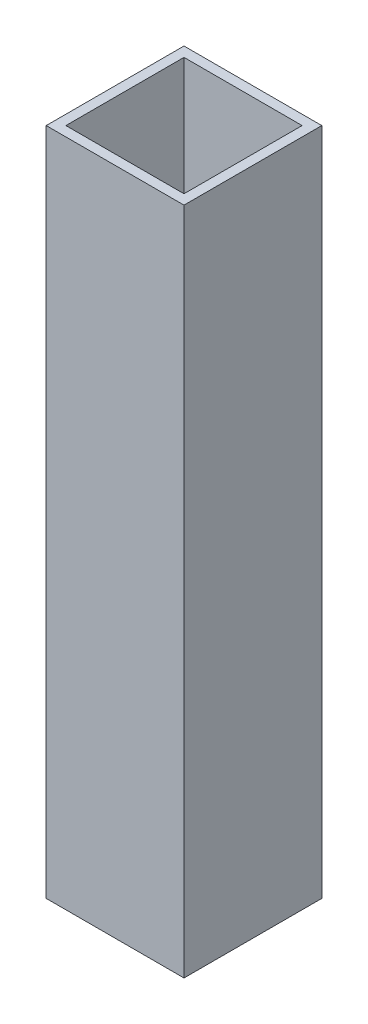
ISO-10303-21;
HEADER;
FILE_DESCRIPTION(('STEP AP214'),'2;1');
FILE_NAME('part.step','',(''),(''),'','','');
FILE_SCHEMA(('AUTOMOTIVE_DESIGN { 1 0 10303 214 1 1 1 1 }'));
ENDSEC;
DATA;
#1=APPLICATION_CONTEXT('core data for automotive mechanical design processes');
#2=APPLICATION_PROTOCOL_DEFINITION('international standard','automotive_design',2000,#1);
#3=PRODUCT_CONTEXT('',#1,'mechanical');
#4=PRODUCT('Part','Part','',(#3));
#5=PRODUCT_RELATED_PRODUCT_CATEGORY('part','',(#4));
#6=PRODUCT_DEFINITION_FORMATION('','',#4);
#7=PRODUCT_DEFINITION_CONTEXT('part definition',#1,'design');
#8=PRODUCT_DEFINITION('design','',#6,#7);
#9=PRODUCT_DEFINITION_SHAPE('','',#8);
#10=(LENGTH_UNIT() NAMED_UNIT(*) SI_UNIT(.MILLI.,.METRE.));
#11=(NAMED_UNIT(*) PLANE_ANGLE_UNIT() SI_UNIT($,.RADIAN.));
#12=(NAMED_UNIT(*) SI_UNIT($,.STERADIAN.) SOLID_ANGLE_UNIT());
#13=UNCERTAINTY_MEASURE_WITH_UNIT(LENGTH_MEASURE(1.E-05),#10,'distance_accuracy_value','');
#14=(GEOMETRIC_REPRESENTATION_CONTEXT(3) GLOBAL_UNCERTAINTY_ASSIGNED_CONTEXT((#13)) GLOBAL_UNIT_ASSIGNED_CONTEXT((#10,
#11,#12)) REPRESENTATION_CONTEXT('',''));
#15=CARTESIAN_POINT('',(0.,0.,0.));
#16=DIRECTION('',(0.,0.,1.));
#17=DIRECTION('',(1.,0.,0.));
#18=AXIS2_PLACEMENT_3D('',#15,#16,#17);
#19=CARTESIAN_POINT('',(-22.225,-215.9,-3.175));
#20=DIRECTION('',(0.,0.,-1.));
#21=DIRECTION('',(-1.,0.,0.));
#22=AXIS2_PLACEMENT_3D('',#19,#20,#21);
#23=PLANE('',#22);
#24=DIRECTION('',(1.,0.,0.));
#25=VECTOR('',#24,1.);
#26=CARTESIAN_POINT('',(-22.225,-215.9,-3.175));
#27=LINE('',#26,#25);
#28=CARTESIAN_POINT('',(-41.275,-215.9,-3.175));
#29=VERTEX_POINT('',#28);
#30=CARTESIAN_POINT('',(-3.175,-215.9,-3.175));
#31=VERTEX_POINT('',#30);
#32=EDGE_CURVE('E120',#29,#31,#27,.T.);
#33=ORIENTED_EDGE('',*,*,#32,.F.);
#34=DIRECTION('',(0.,1.,0.));
#35=VECTOR('',#34,1.);
#36=CARTESIAN_POINT('',(-41.275,-215.9,-3.175));
#37=LINE('',#36,#35);
#38=CARTESIAN_POINT('',(-41.275,0.,-3.175));
#39=VERTEX_POINT('',#38);
#40=EDGE_CURVE('E96',#39,#29,#37,.F.);
#41=ORIENTED_EDGE('',*,*,#40,.F.);
#42=DIRECTION('',(1.,0.,0.));
#43=VECTOR('',#42,1.);
#44=CARTESIAN_POINT('',(-22.225,0.,-3.175));
#45=LINE('',#44,#43);
#46=CARTESIAN_POINT('',(-3.175,0.,-3.175));
#47=VERTEX_POINT('',#46);
#48=EDGE_CURVE('E103',#39,#47,#45,.T.);
#49=ORIENTED_EDGE('',*,*,#48,.T.);
#50=DIRECTION('',(0.,1.,0.));
#51=VECTOR('',#50,1.);
#52=CARTESIAN_POINT('',(-3.17500000000001,-215.9,-3.175));
#53=LINE('',#52,#51);
#54=EDGE_CURVE('E17',#47,#31,#53,.F.);
#55=ORIENTED_EDGE('',*,*,#54,.T.);
#56=EDGE_LOOP('',(#33,#41,#49,#55));
#57=FACE_BOUND('',#56,.T.);
#58=ADVANCED_FACE('F14',(#57),#23,.T.);
#59=CARTESIAN_POINT('',(-3.175,-215.9,-22.225));
#60=DIRECTION('',(1.,0.,0.));
#61=DIRECTION('',(0.,0.,-1.));
#62=AXIS2_PLACEMENT_3D('',#59,#60,#61);
#63=PLANE('',#62);
#64=DIRECTION('',(0.,1.,0.));
#65=VECTOR('',#64,1.);
#66=CARTESIAN_POINT('',(-3.175,-215.9,-41.275));
#67=LINE('',#66,#65);
#68=CARTESIAN_POINT('',(-3.175,0.,-41.275));
#69=VERTEX_POINT('',#68);
#70=CARTESIAN_POINT('',(-3.175,-215.9,-41.275));
#71=VERTEX_POINT('',#70);
#72=EDGE_CURVE('E82',#69,#71,#67,.F.);
#73=ORIENTED_EDGE('',*,*,#72,.T.);
#74=DIRECTION('',(0.,0.,-1.));
#75=VECTOR('',#74,1.);
#76=CARTESIAN_POINT('',(-3.175,-215.9,-22.225));
#77=LINE('',#76,#75);
#78=EDGE_CURVE('E124',#31,#71,#77,.T.);
#79=ORIENTED_EDGE('',*,*,#78,.F.);
#80=ORIENTED_EDGE('',*,*,#54,.F.);
#81=DIRECTION('',(0.,0.,-1.));
#82=VECTOR('',#81,1.);
#83=CARTESIAN_POINT('',(-3.175,0.,-22.225));
#84=LINE('',#83,#82);
#85=EDGE_CURVE('E79',#47,#69,#84,.T.);
#86=ORIENTED_EDGE('',*,*,#85,.T.);
#87=EDGE_LOOP('',(#73,#79,#80,#86));
#88=FACE_BOUND('',#87,.T.);
#89=ADVANCED_FACE('F81',(#88),#63,.F.);
#90=CARTESIAN_POINT('',(-22.225,-215.9,-41.275));
#91=DIRECTION('',(0.,0.,-1.));
#92=DIRECTION('',(-1.,0.,0.));
#93=AXIS2_PLACEMENT_3D('',#90,#91,#92);
#94=PLANE('',#93);
#95=DIRECTION('',(0.,1.,0.));
#96=VECTOR('',#95,1.);
#97=CARTESIAN_POINT('',(-41.275,-215.9,-41.275));
#98=LINE('',#97,#96);
#99=CARTESIAN_POINT('',(-41.275,-215.9,-41.275));
#100=VERTEX_POINT('',#99);
#101=CARTESIAN_POINT('',(-41.275,0.,-41.275));
#102=VERTEX_POINT('',#101);
#103=EDGE_CURVE('E108',#100,#102,#98,.T.);
#104=ORIENTED_EDGE('',*,*,#103,.F.);
#105=DIRECTION('',(1.,0.,0.));
#106=VECTOR('',#105,1.);
#107=CARTESIAN_POINT('',(-22.225,-215.9,-41.275));
#108=LINE('',#107,#106);
#109=EDGE_CURVE('E94',#71,#100,#108,.F.);
#110=ORIENTED_EDGE('',*,*,#109,.F.);
#111=ORIENTED_EDGE('',*,*,#72,.F.);
#112=DIRECTION('',(1.,0.,0.));
#113=VECTOR('',#112,1.);
#114=CARTESIAN_POINT('',(-22.225,0.,-41.275));
#115=LINE('',#114,#113);
#116=EDGE_CURVE('E87',#69,#102,#115,.F.);
#117=ORIENTED_EDGE('',*,*,#116,.T.);
#118=EDGE_LOOP('',(#104,#110,#111,#117));
#119=FACE_BOUND('',#118,.T.);
#120=ADVANCED_FACE('F91',(#119),#94,.F.);
#121=CARTESIAN_POINT('',(-41.275,-215.9,-22.225));
#122=DIRECTION('',(1.,0.,0.));
#123=DIRECTION('',(0.,0.,-1.));
#124=AXIS2_PLACEMENT_3D('',#121,#122,#123);
#125=PLANE('',#124);
#126=DIRECTION('',(0.,0.,-1.));
#127=VECTOR('',#126,1.);
#128=CARTESIAN_POINT('',(-41.275,-215.9,-22.225));
#129=LINE('',#128,#127);
#130=EDGE_CURVE('E115',#100,#29,#129,.F.);
#131=ORIENTED_EDGE('',*,*,#130,.F.);
#132=ORIENTED_EDGE('',*,*,#103,.T.);
#133=DIRECTION('',(0.,0.,-1.));
#134=VECTOR('',#133,1.);
#135=CARTESIAN_POINT('',(-41.275,0.,-22.225));
#136=LINE('',#135,#134);
#137=EDGE_CURVE('E101',#102,#39,#136,.F.);
#138=ORIENTED_EDGE('',*,*,#137,.T.);
#139=ORIENTED_EDGE('',*,*,#40,.T.);
#140=EDGE_LOOP('',(#131,#132,#138,#139));
#141=FACE_BOUND('',#140,.T.);
#142=ADVANCED_FACE('F114',(#141),#125,.T.);
#143=CARTESIAN_POINT('',(-22.225,-215.9,0.));
#144=DIRECTION('',(0.,0.,-1.));
#145=DIRECTION('',(-1.,0.,0.));
#146=AXIS2_PLACEMENT_3D('',#143,#144,#145);
#147=PLANE('',#146);
#148=DIRECTION('',(0.,1.,0.));
#149=VECTOR('',#148,1.);
#150=CARTESIAN_POINT('',(-44.45,-215.9,0.));
#151=LINE('',#150,#149);
#152=CARTESIAN_POINT('',(-44.45,0.,0.));
#153=VERTEX_POINT('',#152);
#154=CARTESIAN_POINT('',(-44.45,-215.9,0.));
#155=VERTEX_POINT('',#154);
#156=EDGE_CURVE('E121',#153,#155,#151,.F.);
#157=ORIENTED_EDGE('',*,*,#156,.T.);
#158=DIRECTION('',(1.,0.,0.));
#159=VECTOR('',#158,1.);
#160=CARTESIAN_POINT('',(-22.225,-215.9,0.));
#161=LINE('',#160,#159);
#162=CARTESIAN_POINT('',(0.,-215.9,0.));
#163=VERTEX_POINT('',#162);
#164=EDGE_CURVE('E130',#163,#155,#161,.F.);
#165=ORIENTED_EDGE('',*,*,#164,.F.);
#166=DIRECTION('',(0.,1.,0.));
#167=VECTOR('',#166,1.);
#168=CARTESIAN_POINT('',(0.,-215.9,0.));
#169=LINE('',#168,#167);
#170=CARTESIAN_POINT('',(0.,0.,0.));
#171=VERTEX_POINT('',#170);
#172=EDGE_CURVE('E135',#171,#163,#169,.F.);
#173=ORIENTED_EDGE('',*,*,#172,.F.);
#174=DIRECTION('',(1.,0.,0.));
#175=VECTOR('',#174,1.);
#176=CARTESIAN_POINT('',(-22.225,0.,0.));
#177=LINE('',#176,#175);
#178=EDGE_CURVE('E88',#171,#153,#177,.F.);
#179=ORIENTED_EDGE('',*,*,#178,.T.);
#180=EDGE_LOOP('',(#157,#165,#173,#179));
#181=FACE_BOUND('',#180,.T.);
#182=ADVANCED_FACE('F164',(#181),#147,.F.);
#183=CARTESIAN_POINT('',(-22.225,0.,-22.225));
#184=DIRECTION('',(0.,-1.,0.));
#185=DIRECTION('',(0.,0.,-1.));
#186=AXIS2_PLACEMENT_3D('',#183,#184,#185);
#187=PLANE('',#186);
#188=ORIENTED_EDGE('',*,*,#137,.F.);
#189=ORIENTED_EDGE('',*,*,#116,.F.);
#190=ORIENTED_EDGE('',*,*,#85,.F.);
#191=ORIENTED_EDGE('',*,*,#48,.F.);
#192=EDGE_LOOP('',(#188,#189,#190,#191));
#193=FACE_BOUND('',#192,.T.);
#194=DIRECTION('',(-1.,0.,0.));
#195=VECTOR('',#194,1.);
#196=CARTESIAN_POINT('',(-22.225,0.,-44.45));
#197=LINE('',#196,#195);
#198=CARTESIAN_POINT('',(-44.45,0.,-44.45));
#199=VERTEX_POINT('',#198);
#200=CARTESIAN_POINT('',(0.,0.,-44.45));
#201=VERTEX_POINT('',#200);
#202=EDGE_CURVE('E240',#199,#201,#197,.F.);
#203=ORIENTED_EDGE('',*,*,#202,.F.);
#204=DIRECTION('',(0.,0.,-1.));
#205=VECTOR('',#204,1.);
#206=CARTESIAN_POINT('',(-44.45,0.,-22.225));
#207=LINE('',#206,#205);
#208=EDGE_CURVE('E239',#199,#153,#207,.F.);
#209=ORIENTED_EDGE('',*,*,#208,.T.);
#210=ORIENTED_EDGE('',*,*,#178,.F.);
#211=DIRECTION('',(0.,0.,-1.));
#212=VECTOR('',#211,1.);
#213=CARTESIAN_POINT('',(0.,0.,-22.225));
#214=LINE('',#213,#212);
#215=EDGE_CURVE('E137',#201,#171,#214,.F.);
#216=ORIENTED_EDGE('',*,*,#215,.F.);
#217=EDGE_LOOP('',(#203,#209,#210,#216));
#218=FACE_BOUND('',#217,.T.);
#219=ADVANCED_FACE('F98',(#193,#218),#187,.F.);
#220=CARTESIAN_POINT('',(0.,-215.9,-22.225));
#221=DIRECTION('',(1.,0.,0.));
#222=DIRECTION('',(0.,0.,-1.));
#223=AXIS2_PLACEMENT_3D('',#220,#221,#222);
#224=PLANE('',#223);
#225=DIRECTION('',(0.,0.,-1.));
#226=VECTOR('',#225,1.);
#227=CARTESIAN_POINT('',(0.,-215.9,-22.225));
#228=LINE('',#227,#226);
#229=CARTESIAN_POINT('',(0.,-215.9,-44.45));
#230=VERTEX_POINT('',#229);
#231=EDGE_CURVE('E132',#230,#163,#228,.F.);
#232=ORIENTED_EDGE('',*,*,#231,.F.);
#233=DIRECTION('',(0.,1.,0.));
#234=VECTOR('',#233,1.);
#235=CARTESIAN_POINT('',(0.,-215.9,-44.45));
#236=LINE('',#235,#234);
#237=EDGE_CURVE('E245',#201,#230,#236,.F.);
#238=ORIENTED_EDGE('',*,*,#237,.F.);
#239=ORIENTED_EDGE('',*,*,#215,.T.);
#240=ORIENTED_EDGE('',*,*,#172,.T.);
#241=EDGE_LOOP('',(#232,#238,#239,#240));
#242=FACE_BOUND('',#241,.T.);
#243=ADVANCED_FACE('F158',(#242),#224,.T.);
#244=CARTESIAN_POINT('',(-22.225,-215.9,-22.225));
#245=DIRECTION('',(0.,-1.,0.));
#246=DIRECTION('',(0.,0.,-1.));
#247=AXIS2_PLACEMENT_3D('',#244,#245,#246);
#248=PLANE('',#247);
#249=ORIENTED_EDGE('',*,*,#109,.T.);
#250=ORIENTED_EDGE('',*,*,#130,.T.);
#251=ORIENTED_EDGE('',*,*,#32,.T.);
#252=ORIENTED_EDGE('',*,*,#78,.T.);
#253=EDGE_LOOP('',(#249,#250,#251,#252));
#254=FACE_BOUND('',#253,.T.);
#255=DIRECTION('',(0.,0.,-1.));
#256=VECTOR('',#255,1.);
#257=CARTESIAN_POINT('',(-44.45,-215.9,-22.225));
#258=LINE('',#257,#256);
#259=CARTESIAN_POINT('',(-44.45,-215.9,-44.45));
#260=VERTEX_POINT('',#259);
#261=EDGE_CURVE('E32',#155,#260,#258,.T.);
#262=ORIENTED_EDGE('',*,*,#261,.T.);
#263=DIRECTION('',(-1.,0.,0.));
#264=VECTOR('',#263,1.);
#265=CARTESIAN_POINT('',(-22.225,-215.9,-44.45));
#266=LINE('',#265,#264);
#267=EDGE_CURVE('E23',#230,#260,#266,.T.);
#268=ORIENTED_EDGE('',*,*,#267,.F.);
#269=ORIENTED_EDGE('',*,*,#231,.T.);
#270=ORIENTED_EDGE('',*,*,#164,.T.);
#271=EDGE_LOOP('',(#262,#268,#269,#270));
#272=FACE_BOUND('',#271,.T.);
#273=ADVANCED_FACE('F119',(#254,#272),#248,.T.);
#274=CARTESIAN_POINT('',(-44.45,-215.9,-22.225));
#275=DIRECTION('',(1.,0.,0.));
#276=DIRECTION('',(0.,0.,-1.));
#277=AXIS2_PLACEMENT_3D('',#274,#275,#276);
#278=PLANE('',#277);
#279=DIRECTION('',(0.,1.,0.));
#280=VECTOR('',#279,1.);
#281=CARTESIAN_POINT('',(-44.45,-215.9,-44.45));
#282=LINE('',#281,#280);
#283=EDGE_CURVE('E9',#260,#199,#282,.T.);
#284=ORIENTED_EDGE('',*,*,#283,.F.);
#285=ORIENTED_EDGE('',*,*,#261,.F.);
#286=ORIENTED_EDGE('',*,*,#156,.F.);
#287=ORIENTED_EDGE('',*,*,#208,.F.);
#288=EDGE_LOOP('',(#284,#285,#286,#287));
#289=FACE_BOUND('',#288,.T.);
#290=ADVANCED_FACE('F146',(#289),#278,.F.);
#291=CARTESIAN_POINT('',(-22.225,-215.9,-44.45));
#292=DIRECTION('',(0.,0.,-1.));
#293=DIRECTION('',(-1.,0.,0.));
#294=AXIS2_PLACEMENT_3D('',#291,#292,#293);
#295=PLANE('',#294);
#296=ORIENTED_EDGE('',*,*,#267,.T.);
#297=ORIENTED_EDGE('',*,*,#283,.T.);
#298=ORIENTED_EDGE('',*,*,#202,.T.);
#299=ORIENTED_EDGE('',*,*,#237,.T.);
#300=EDGE_LOOP('',(#296,#297,#298,#299));
#301=FACE_BOUND('',#300,.T.);
#302=ADVANCED_FACE('F144',(#301),#295,.T.);
#303=CLOSED_SHELL('',(#58,#89,#120,#142,#182,#219,#243,#273,#290,#302));
#304=MANIFOLD_SOLID_BREP('B1',#303);
#305=ADVANCED_BREP_SHAPE_REPRESENTATION('',(#18,#304),#14);
#306=SHAPE_DEFINITION_REPRESENTATION(#9,#305);
ENDSEC;
END-ISO-10303-21;
